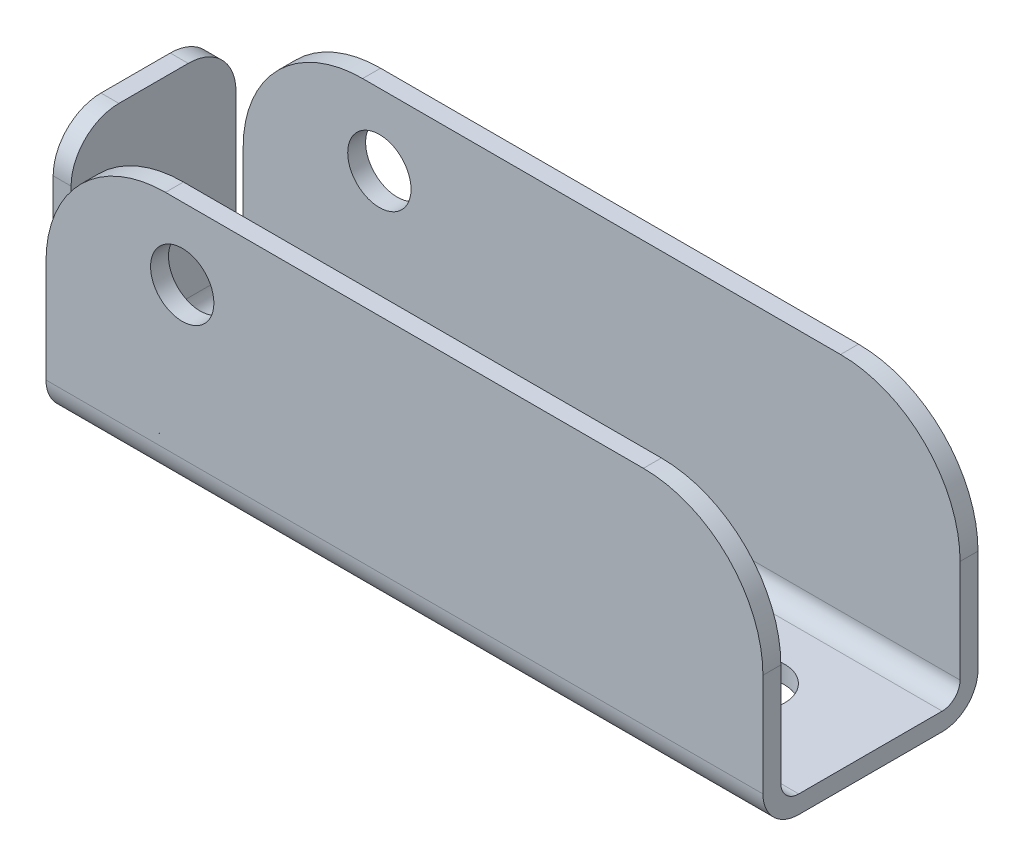
ISO-10303-21;
HEADER;
FILE_DESCRIPTION(('STEP AP214'),'2;1');
FILE_NAME('part.step','',(''),(''),'','','');
FILE_SCHEMA(('AUTOMOTIVE_DESIGN { 1 0 10303 214 1 1 1 1 }'));
ENDSEC;
DATA;
#1=APPLICATION_CONTEXT('core data for automotive mechanical design processes');
#2=APPLICATION_PROTOCOL_DEFINITION('international standard','automotive_design',2000,#1);
#3=PRODUCT_CONTEXT('',#1,'mechanical');
#4=PRODUCT('Part','Part','',(#3));
#5=PRODUCT_RELATED_PRODUCT_CATEGORY('part','',(#4));
#6=PRODUCT_DEFINITION_FORMATION('','',#4);
#7=PRODUCT_DEFINITION_CONTEXT('part definition',#1,'design');
#8=PRODUCT_DEFINITION('design','',#6,#7);
#9=PRODUCT_DEFINITION_SHAPE('','',#8);
#10=(LENGTH_UNIT() NAMED_UNIT(*) SI_UNIT(.MILLI.,.METRE.));
#11=(NAMED_UNIT(*) PLANE_ANGLE_UNIT() SI_UNIT($,.RADIAN.));
#12=(NAMED_UNIT(*) SI_UNIT($,.STERADIAN.) SOLID_ANGLE_UNIT());
#13=UNCERTAINTY_MEASURE_WITH_UNIT(LENGTH_MEASURE(1.E-05),#10,'distance_accuracy_value','');
#14=(GEOMETRIC_REPRESENTATION_CONTEXT(3) GLOBAL_UNCERTAINTY_ASSIGNED_CONTEXT((#13)) GLOBAL_UNIT_ASSIGNED_CONTEXT((#10,
#11,#12)) REPRESENTATION_CONTEXT('',''));
#15=CARTESIAN_POINT('',(0.,0.,0.));
#16=DIRECTION('',(0.,0.,1.));
#17=DIRECTION('',(1.,0.,0.));
#18=AXIS2_PLACEMENT_3D('',#15,#16,#17);
#19=CARTESIAN_POINT('',(0.,1.905,0.));
#20=DIRECTION('',(0.,-1.,0.));
#21=DIRECTION('',(0.,0.,-1.));
#22=AXIS2_PLACEMENT_3D('',#19,#20,#21);
#23=PLANE('',#22);
#24=CARTESIAN_POINT('',(65.405,1.905,0.));
#25=DIRECTION('',(0.,1.,0.));
#26=DIRECTION('',(0.,0.,1.));
#27=AXIS2_PLACEMENT_3D('',#24,#25,#26);
#28=CIRCLE('',#27,3.5687);
#29=CARTESIAN_POINT('',(65.405,1.905,3.5687));
#30=VERTEX_POINT('',#29);
#31=EDGE_CURVE('E273',#30,#30,#28,.T.);
#32=ORIENTED_EDGE('',*,*,#31,.F.);
#33=EDGE_LOOP('',(#32));
#34=FACE_BOUND('',#33,.T.);
#35=CARTESIAN_POINT('',(27.305,1.905,0.));
#36=DIRECTION('',(0.,1.,0.));
#37=DIRECTION('',(0.,0.,1.));
#38=AXIS2_PLACEMENT_3D('',#35,#36,#37);
#39=CIRCLE('',#38,3.5687);
#40=CARTESIAN_POINT('',(27.305,1.905,3.56870000000001));
#41=VERTEX_POINT('',#40);
#42=EDGE_CURVE('E562',#41,#41,#39,.T.);
#43=ORIENTED_EDGE('',*,*,#42,.F.);
#44=EDGE_LOOP('',(#43));
#45=FACE_BOUND('',#44,.T.);
#46=DIRECTION('',(0.,0.,-1.));
#47=VECTOR('',#46,1.);
#48=CARTESIAN_POINT('',(3.81,1.905,8.76299999999999));
#49=LINE('',#48,#47);
#50=CARTESIAN_POINT('',(3.80999999999999,1.905,-7.61999999999999));
#51=VERTEX_POINT('',#50);
#52=CARTESIAN_POINT('',(3.81,1.905,7.61999999999998));
#53=VERTEX_POINT('',#52);
#54=EDGE_CURVE('E343',#51,#53,#49,.F.);
#55=ORIENTED_EDGE('',*,*,#54,.T.);
#56=DIRECTION('',(-1.,0.,0.));
#57=VECTOR('',#56,1.);
#58=CARTESIAN_POINT('',(78.105,1.905,7.61999999999997));
#59=LINE('',#58,#57);
#60=CARTESIAN_POINT('',(78.105,1.905,7.61999999999997));
#61=VERTEX_POINT('',#60);
#62=EDGE_CURVE('E384',#53,#61,#59,.F.);
#63=ORIENTED_EDGE('',*,*,#62,.T.);
#64=DIRECTION('',(0.,0.,-1.));
#65=VECTOR('',#64,1.);
#66=CARTESIAN_POINT('',(78.105,1.905,-11.43));
#67=LINE('',#66,#65);
#68=CARTESIAN_POINT('',(78.105,1.905,-7.62));
#69=VERTEX_POINT('',#68);
#70=EDGE_CURVE('E260',#61,#69,#67,.T.);
#71=ORIENTED_EDGE('',*,*,#70,.T.);
#72=DIRECTION('',(1.,0.,0.));
#73=VECTOR('',#72,1.);
#74=CARTESIAN_POINT('',(1.90499999999999,1.905,-7.61999999999999));
#75=LINE('',#74,#73);
#76=EDGE_CURVE('E382',#69,#51,#75,.F.);
#77=ORIENTED_EDGE('',*,*,#76,.T.);
#78=EDGE_LOOP('',(#55,#63,#71,#77));
#79=FACE_BOUND('',#78,.T.);
#80=ADVANCED_FACE('F39',(#34,#45,#79),#23,.F.);
#81=CARTESIAN_POINT('',(0.,1.905,-11.43));
#82=DIRECTION('',(0.,0.,1.));
#83=DIRECTION('',(1.,0.,0.));
#84=AXIS2_PLACEMENT_3D('',#81,#82,#83);
#85=PLANE('',#84);
#86=CARTESIAN_POINT('',(16.383,19.812,-11.43));
#87=DIRECTION('',(0.,0.,1.));
#88=DIRECTION('',(1.,0.,0.));
#89=AXIS2_PLACEMENT_3D('',#86,#87,#88);
#90=CIRCLE('',#89,3.3655);
#91=CARTESIAN_POINT('',(19.7485,19.812,-11.43));
#92=VERTEX_POINT('',#91);
#93=EDGE_CURVE('E565',#92,#92,#90,.T.);
#94=ORIENTED_EDGE('',*,*,#93,.T.);
#95=EDGE_LOOP('',(#94));
#96=FACE_BOUND('',#95,.T.);
#97=DIRECTION('',(0.,-1.,0.));
#98=VECTOR('',#97,1.);
#99=CARTESIAN_POINT('',(78.105,1.905,-11.43));
#100=LINE('',#99,#98);
#101=CARTESIAN_POINT('',(78.105,14.732,-11.43));
#102=VERTEX_POINT('',#101);
#103=CARTESIAN_POINT('',(78.105,3.81,-11.43));
#104=VERTEX_POINT('',#103);
#105=EDGE_CURVE('E263',#102,#104,#100,.T.);
#106=ORIENTED_EDGE('',*,*,#105,.T.);
#107=DIRECTION('',(-1.,0.,0.));
#108=VECTOR('',#107,1.);
#109=CARTESIAN_POINT('',(3.81,3.81,-11.43));
#110=LINE('',#109,#108);
#111=CARTESIAN_POINT('',(1.905,3.81000000000001,-11.43));
#112=VERTEX_POINT('',#111);
#113=EDGE_CURVE('E368',#104,#112,#110,.T.);
#114=ORIENTED_EDGE('',*,*,#113,.T.);
#115=DIRECTION('',(0.,-1.,0.));
#116=VECTOR('',#115,1.);
#117=CARTESIAN_POINT('',(1.905,27.432,-11.43));
#118=LINE('',#117,#116);
#119=CARTESIAN_POINT('',(1.905,14.732,-11.43));
#120=VERTEX_POINT('',#119);
#121=EDGE_CURVE('E435',#120,#112,#118,.T.);
#122=ORIENTED_EDGE('',*,*,#121,.F.);
#123=CARTESIAN_POINT('',(14.605,14.732,-11.43));
#124=DIRECTION('',(0.,0.,1.));
#125=DIRECTION('',(1.,0.,0.));
#126=AXIS2_PLACEMENT_3D('',#123,#124,#125);
#127=CIRCLE('',#126,12.7);
#128=CARTESIAN_POINT('',(14.605,27.432,-11.43));
#129=VERTEX_POINT('',#128);
#130=EDGE_CURVE('E221',#120,#129,#127,.F.);
#131=ORIENTED_EDGE('',*,*,#130,.T.);
#132=DIRECTION('',(-1.,0.,0.));
#133=VECTOR('',#132,1.);
#134=CARTESIAN_POINT('',(1.905,27.432,-11.43));
#135=LINE('',#134,#133);
#136=CARTESIAN_POINT('',(65.405,27.432,-11.43));
#137=VERTEX_POINT('',#136);
#138=EDGE_CURVE('E229',#137,#129,#135,.T.);
#139=ORIENTED_EDGE('',*,*,#138,.F.);
#140=CARTESIAN_POINT('',(65.405,14.732,-11.43));
#141=DIRECTION('',(0.,0.,1.));
#142=DIRECTION('',(1.,0.,0.));
#143=AXIS2_PLACEMENT_3D('',#140,#141,#142);
#144=CIRCLE('',#143,12.7);
#145=EDGE_CURVE('E211',#137,#102,#144,.F.);
#146=ORIENTED_EDGE('',*,*,#145,.T.);
#147=EDGE_LOOP('',(#106,#114,#122,#131,#139,#146));
#148=FACE_BOUND('',#147,.T.);
#149=ADVANCED_FACE('F236',(#96,#148),#85,.F.);
#150=CARTESIAN_POINT('',(0.,1.905,11.43));
#151=DIRECTION('',(1.,0.,0.));
#152=DIRECTION('',(0.,0.,-1.));
#153=AXIS2_PLACEMENT_3D('',#150,#151,#152);
#154=PLANE('',#153);
#155=DIRECTION('',(0.,-1.,0.));
#156=VECTOR('',#155,1.);
#157=CARTESIAN_POINT('',(0.,25.4,-8.76299999999999));
#158=LINE('',#157,#156);
#159=CARTESIAN_POINT('',(0.,20.32,-8.76299999999999));
#160=VERTEX_POINT('',#159);
#161=CARTESIAN_POINT('',(0.,3.81,-8.76299999999999));
#162=VERTEX_POINT('',#161);
#163=EDGE_CURVE('E432',#160,#162,#158,.T.);
#164=ORIENTED_EDGE('',*,*,#163,.T.);
#165=DIRECTION('',(0.,0.,1.));
#166=VECTOR('',#165,1.);
#167=CARTESIAN_POINT('',(0.,3.81,8.76299999999999));
#168=LINE('',#167,#166);
#169=CARTESIAN_POINT('',(0.,3.81,8.76299999999999));
#170=VERTEX_POINT('',#169);
#171=EDGE_CURVE('E325',#162,#170,#168,.T.);
#172=ORIENTED_EDGE('',*,*,#171,.T.);
#173=DIRECTION('',(0.,-1.,0.));
#174=VECTOR('',#173,1.);
#175=CARTESIAN_POINT('',(0.,25.4,8.76299999999999));
#176=LINE('',#175,#174);
#177=CARTESIAN_POINT('',(0.,20.32,8.76299999999999));
#178=VERTEX_POINT('',#177);
#179=EDGE_CURVE('E423',#178,#170,#176,.T.);
#180=ORIENTED_EDGE('',*,*,#179,.F.);
#181=CARTESIAN_POINT('',(0.,20.32,3.68299999999999));
#182=DIRECTION('',(1.,0.,0.));
#183=DIRECTION('',(0.,0.,-1.));
#184=AXIS2_PLACEMENT_3D('',#181,#182,#183);
#185=CIRCLE('',#184,5.08);
#186=CARTESIAN_POINT('',(0.,25.4,3.68299999999999));
#187=VERTEX_POINT('',#186);
#188=EDGE_CURVE('E313',#178,#187,#185,.F.);
#189=ORIENTED_EDGE('',*,*,#188,.T.);
#190=DIRECTION('',(0.,0.,1.));
#191=VECTOR('',#190,1.);
#192=CARTESIAN_POINT('',(0.,25.4,8.76299999999999));
#193=LINE('',#192,#191);
#194=CARTESIAN_POINT('',(0.,25.4,-3.68299999999999));
#195=VERTEX_POINT('',#194);
#196=EDGE_CURVE('E426',#195,#187,#193,.T.);
#197=ORIENTED_EDGE('',*,*,#196,.F.);
#198=CARTESIAN_POINT('',(0.,20.32,-3.68299999999999));
#199=DIRECTION('',(1.,0.,0.));
#200=DIRECTION('',(0.,0.,-1.));
#201=AXIS2_PLACEMENT_3D('',#198,#199,#200);
#202=CIRCLE('',#201,5.08);
#203=EDGE_CURVE('E315',#195,#160,#202,.F.);
#204=ORIENTED_EDGE('',*,*,#203,.T.);
#205=EDGE_LOOP('',(#164,#172,#180,#189,#197,#204));
#206=FACE_BOUND('',#205,.T.);
#207=ADVANCED_FACE('F467',(#206),#154,.F.);
#208=CARTESIAN_POINT('',(78.105,1.905,11.43));
#209=DIRECTION('',(0.,0.,-1.));
#210=DIRECTION('',(-1.,0.,0.));
#211=AXIS2_PLACEMENT_3D('',#208,#209,#210);
#212=PLANE('',#211);
#213=CARTESIAN_POINT('',(16.383,19.812,11.43));
#214=DIRECTION('',(0.,0.,1.));
#215=DIRECTION('',(1.,0.,0.));
#216=AXIS2_PLACEMENT_3D('',#213,#214,#215);
#217=CIRCLE('',#216,3.3655);
#218=CARTESIAN_POINT('',(19.7485,19.812,11.43));
#219=VERTEX_POINT('',#218);
#220=EDGE_CURVE('E279',#219,#219,#217,.T.);
#221=ORIENTED_EDGE('',*,*,#220,.F.);
#222=EDGE_LOOP('',(#221));
#223=FACE_BOUND('',#222,.T.);
#224=DIRECTION('',(0.,-1.,0.));
#225=VECTOR('',#224,1.);
#226=CARTESIAN_POINT('',(1.905,27.432,11.43));
#227=LINE('',#226,#225);
#228=CARTESIAN_POINT('',(1.905,14.732,11.43));
#229=VERTEX_POINT('',#228);
#230=CARTESIAN_POINT('',(1.905,3.81000000000001,11.43));
#231=VERTEX_POINT('',#230);
#232=EDGE_CURVE('E250',#229,#231,#227,.T.);
#233=ORIENTED_EDGE('',*,*,#232,.T.);
#234=DIRECTION('',(1.,0.,0.));
#235=VECTOR('',#234,1.);
#236=CARTESIAN_POINT('',(78.105,3.81,11.43));
#237=LINE('',#236,#235);
#238=CARTESIAN_POINT('',(78.105,3.81,11.43));
#239=VERTEX_POINT('',#238);
#240=EDGE_CURVE('E351',#231,#239,#237,.T.);
#241=ORIENTED_EDGE('',*,*,#240,.T.);
#242=DIRECTION('',(0.,-1.,0.));
#243=VECTOR('',#242,1.);
#244=CARTESIAN_POINT('',(78.105,1.905,11.43));
#245=LINE('',#244,#243);
#246=CARTESIAN_POINT('',(78.105,14.732,11.43));
#247=VERTEX_POINT('',#246);
#248=EDGE_CURVE('E234',#247,#239,#245,.T.);
#249=ORIENTED_EDGE('',*,*,#248,.F.);
#250=CARTESIAN_POINT('',(65.405,14.732,11.43));
#251=DIRECTION('',(0.,0.,-1.));
#252=DIRECTION('',(-1.,0.,0.));
#253=AXIS2_PLACEMENT_3D('',#250,#251,#252);
#254=CIRCLE('',#253,12.7);
#255=CARTESIAN_POINT('',(65.405,27.432,11.43));
#256=VERTEX_POINT('',#255);
#257=EDGE_CURVE('E294',#247,#256,#254,.F.);
#258=ORIENTED_EDGE('',*,*,#257,.T.);
#259=DIRECTION('',(1.,0.,0.));
#260=VECTOR('',#259,1.);
#261=CARTESIAN_POINT('',(1.905,27.432,11.43));
#262=LINE('',#261,#260);
#263=CARTESIAN_POINT('',(14.605,27.432,11.43));
#264=VERTEX_POINT('',#263);
#265=EDGE_CURVE('E239',#264,#256,#262,.T.);
#266=ORIENTED_EDGE('',*,*,#265,.F.);
#267=CARTESIAN_POINT('',(14.605,14.732,11.43));
#268=DIRECTION('',(0.,0.,-1.));
#269=DIRECTION('',(-1.,0.,0.));
#270=AXIS2_PLACEMENT_3D('',#267,#268,#269);
#271=CIRCLE('',#270,12.7);
#272=EDGE_CURVE('E296',#264,#229,#271,.F.);
#273=ORIENTED_EDGE('',*,*,#272,.T.);
#274=EDGE_LOOP('',(#233,#241,#249,#258,#266,#273));
#275=FACE_BOUND('',#274,.T.);
#276=ADVANCED_FACE('F481',(#223,#275),#212,.F.);
#277=CARTESIAN_POINT('',(78.105,1.905,-11.43));
#278=DIRECTION('',(-1.,0.,0.));
#279=DIRECTION('',(0.,0.,1.));
#280=AXIS2_PLACEMENT_3D('',#277,#278,#279);
#281=PLANE('',#280);
#282=ORIENTED_EDGE('',*,*,#248,.T.);
#283=CARTESIAN_POINT('',(78.105,3.81,7.61999999999997));
#284=DIRECTION('',(-1.,0.,0.));
#285=DIRECTION('',(0.,0.,1.));
#286=AXIS2_PLACEMENT_3D('',#283,#284,#285);
#287=CIRCLE('',#286,3.81);
#288=CARTESIAN_POINT('',(78.105,0.,7.61999999999997));
#289=VERTEX_POINT('',#288);
#290=EDGE_CURVE('E356',#239,#289,#287,.F.);
#291=ORIENTED_EDGE('',*,*,#290,.T.);
#292=DIRECTION('',(0.,0.,-1.));
#293=VECTOR('',#292,1.);
#294=CARTESIAN_POINT('',(78.105,0.,-11.43));
#295=LINE('',#294,#293);
#296=CARTESIAN_POINT('',(78.105,0.,-7.62));
#297=VERTEX_POINT('',#296);
#298=EDGE_CURVE('E259',#289,#297,#295,.T.);
#299=ORIENTED_EDGE('',*,*,#298,.T.);
#300=CARTESIAN_POINT('',(78.105,3.81,-7.62));
#301=DIRECTION('',(-1.,0.,0.));
#302=DIRECTION('',(0.,0.,1.));
#303=AXIS2_PLACEMENT_3D('',#300,#301,#302);
#304=CIRCLE('',#303,3.81);
#305=EDGE_CURVE('E354',#297,#104,#304,.F.);
#306=ORIENTED_EDGE('',*,*,#305,.T.);
#307=ORIENTED_EDGE('',*,*,#105,.F.);
#308=DIRECTION('',(0.,0.,-1.));
#309=VECTOR('',#308,1.);
#310=CARTESIAN_POINT('',(78.105,14.732,-11.43));
#311=LINE('',#310,#309);
#312=CARTESIAN_POINT('',(78.105,14.732,-9.525));
#313=VERTEX_POINT('',#312);
#314=EDGE_CURVE('E216',#102,#313,#311,.F.);
#315=ORIENTED_EDGE('',*,*,#314,.T.);
#316=DIRECTION('',(0.,-1.,0.));
#317=VECTOR('',#316,1.);
#318=CARTESIAN_POINT('',(78.105,27.432,-9.525));
#319=LINE('',#318,#317);
#320=CARTESIAN_POINT('',(78.105,3.81000000000001,-9.525));
#321=VERTEX_POINT('',#320);
#322=EDGE_CURVE('E244',#313,#321,#319,.T.);
#323=ORIENTED_EDGE('',*,*,#322,.T.);
#324=CARTESIAN_POINT('',(78.105,3.81,-7.62));
#325=DIRECTION('',(-1.,0.,0.));
#326=DIRECTION('',(0.,0.,1.));
#327=AXIS2_PLACEMENT_3D('',#324,#325,#326);
#328=CIRCLE('',#327,1.905);
#329=EDGE_CURVE('E47',#321,#69,#328,.T.);
#330=ORIENTED_EDGE('',*,*,#329,.T.);
#331=ORIENTED_EDGE('',*,*,#70,.F.);
#332=CARTESIAN_POINT('',(78.105,3.81,7.61999999999997));
#333=DIRECTION('',(-1.,0.,0.));
#334=DIRECTION('',(0.,0.,1.));
#335=AXIS2_PLACEMENT_3D('',#332,#333,#334);
#336=CIRCLE('',#335,1.905);
#337=CARTESIAN_POINT('',(78.105,3.81000000000001,9.52499999999997));
#338=VERTEX_POINT('',#337);
#339=EDGE_CURVE('E393',#61,#338,#336,.T.);
#340=ORIENTED_EDGE('',*,*,#339,.T.);
#341=DIRECTION('',(0.,-1.,0.));
#342=VECTOR('',#341,1.);
#343=CARTESIAN_POINT('',(78.105,27.432,9.52499999999997));
#344=LINE('',#343,#342);
#345=CARTESIAN_POINT('',(78.105,14.732,9.52499999999997));
#346=VERTEX_POINT('',#345);
#347=EDGE_CURVE('E256',#346,#338,#344,.T.);
#348=ORIENTED_EDGE('',*,*,#347,.F.);
#349=DIRECTION('',(0.,0.,-1.));
#350=VECTOR('',#349,1.);
#351=CARTESIAN_POINT('',(78.105,14.732,11.43));
#352=LINE('',#351,#350);
#353=EDGE_CURVE('E304',#346,#247,#352,.F.);
#354=ORIENTED_EDGE('',*,*,#353,.T.);
#355=EDGE_LOOP('',(#282,#291,#299,#306,#307,#315,#323,#330,#331,#340,#348,#354));
#356=FACE_BOUND('',#355,.T.);
#357=ADVANCED_FACE('F397',(#356),#281,.F.);
#358=CARTESIAN_POINT('',(0.,0.,0.));
#359=DIRECTION('',(0.,-1.,0.));
#360=DIRECTION('',(0.,0.,-1.));
#361=AXIS2_PLACEMENT_3D('',#358,#359,#360);
#362=PLANE('',#361);
#363=CARTESIAN_POINT('',(65.405,0.,0.));
#364=DIRECTION('',(0.,-1.,0.));
#365=DIRECTION('',(0.,0.,-1.));
#366=AXIS2_PLACEMENT_3D('',#363,#364,#365);
#367=CIRCLE('',#366,3.5687);
#368=CARTESIAN_POINT('',(65.405,0.,-3.5687));
#369=VERTEX_POINT('',#368);
#370=EDGE_CURVE('E272',#369,#369,#367,.T.);
#371=ORIENTED_EDGE('',*,*,#370,.F.);
#372=EDGE_LOOP('',(#371));
#373=FACE_BOUND('',#372,.T.);
#374=CARTESIAN_POINT('',(27.305,0.,0.));
#375=DIRECTION('',(0.,-1.,0.));
#376=DIRECTION('',(0.,0.,-1.));
#377=AXIS2_PLACEMENT_3D('',#374,#375,#376);
#378=CIRCLE('',#377,3.5687);
#379=CARTESIAN_POINT('',(27.305,0.,-3.5687));
#380=VERTEX_POINT('',#379);
#381=EDGE_CURVE('E269',#380,#380,#378,.T.);
#382=ORIENTED_EDGE('',*,*,#381,.F.);
#383=EDGE_LOOP('',(#382));
#384=FACE_BOUND('',#383,.T.);
#385=ORIENTED_EDGE('',*,*,#298,.F.);
#386=DIRECTION('',(1.,0.,0.));
#387=VECTOR('',#386,1.);
#388=CARTESIAN_POINT('',(3.80999999999999,0.,7.62));
#389=LINE('',#388,#387);
#390=CARTESIAN_POINT('',(3.81,0.,7.62));
#391=VERTEX_POINT('',#390);
#392=EDGE_CURVE('E360',#289,#391,#389,.F.);
#393=ORIENTED_EDGE('',*,*,#392,.T.);
#394=DIRECTION('',(0.,0.,1.));
#395=VECTOR('',#394,1.);
#396=CARTESIAN_POINT('',(3.81,0.,-8.76299999999999));
#397=LINE('',#396,#395);
#398=CARTESIAN_POINT('',(3.81,0.,-7.62));
#399=VERTEX_POINT('',#398);
#400=EDGE_CURVE('E333',#391,#399,#397,.F.);
#401=ORIENTED_EDGE('',*,*,#400,.T.);
#402=DIRECTION('',(-1.,0.,0.));
#403=VECTOR('',#402,1.);
#404=CARTESIAN_POINT('',(78.105,0.,-7.62));
#405=LINE('',#404,#403);
#406=EDGE_CURVE('E358',#399,#297,#405,.F.);
#407=ORIENTED_EDGE('',*,*,#406,.T.);
#408=EDGE_LOOP('',(#385,#393,#401,#407));
#409=FACE_BOUND('',#408,.T.);
#410=ADVANCED_FACE('F476',(#373,#384,#409),#362,.T.);
#411=CARTESIAN_POINT('',(78.105,27.432,9.52499999999997));
#412=DIRECTION('',(0.,0.,1.));
#413=DIRECTION('',(1.,0.,0.));
#414=AXIS2_PLACEMENT_3D('',#411,#412,#413);
#415=PLANE('',#414);
#416=CARTESIAN_POINT('',(16.383,19.812,9.52499999999998));
#417=DIRECTION('',(0.,0.,1.));
#418=DIRECTION('',(1.,0.,0.));
#419=AXIS2_PLACEMENT_3D('',#416,#417,#418);
#420=CIRCLE('',#419,3.3655);
#421=CARTESIAN_POINT('',(19.7485,19.812,9.52499999999998));
#422=VERTEX_POINT('',#421);
#423=EDGE_CURVE('E278',#422,#422,#420,.T.);
#424=ORIENTED_EDGE('',*,*,#423,.T.);
#425=EDGE_LOOP('',(#424));
#426=FACE_BOUND('',#425,.T.);
#427=ORIENTED_EDGE('',*,*,#347,.T.);
#428=DIRECTION('',(-1.,0.,0.));
#429=VECTOR('',#428,1.);
#430=CARTESIAN_POINT('',(1.905,3.81,9.52499999999998));
#431=LINE('',#430,#429);
#432=CARTESIAN_POINT('',(1.905,3.81000000000001,9.52499999999998));
#433=VERTEX_POINT('',#432);
#434=EDGE_CURVE('E373',#338,#433,#431,.T.);
#435=ORIENTED_EDGE('',*,*,#434,.T.);
#436=DIRECTION('',(0.,-1.,0.));
#437=VECTOR('',#436,1.);
#438=CARTESIAN_POINT('',(1.905,27.432,9.52499999999998));
#439=LINE('',#438,#437);
#440=CARTESIAN_POINT('',(1.905,14.732,9.52499999999998));
#441=VERTEX_POINT('',#440);
#442=EDGE_CURVE('E253',#441,#433,#439,.T.);
#443=ORIENTED_EDGE('',*,*,#442,.F.);
#444=CARTESIAN_POINT('',(14.605,14.732,9.52499999999998));
#445=DIRECTION('',(0.,0.,1.));
#446=DIRECTION('',(1.,0.,0.));
#447=AXIS2_PLACEMENT_3D('',#444,#445,#446);
#448=CIRCLE('',#447,12.7);
#449=CARTESIAN_POINT('',(14.605,27.432,9.52499999999998));
#450=VERTEX_POINT('',#449);
#451=EDGE_CURVE('E302',#441,#450,#448,.F.);
#452=ORIENTED_EDGE('',*,*,#451,.T.);
#453=DIRECTION('',(-1.,0.,0.));
#454=VECTOR('',#453,1.);
#455=CARTESIAN_POINT('',(78.105,27.432,9.52499999999997));
#456=LINE('',#455,#454);
#457=CARTESIAN_POINT('',(65.405,27.432,9.52499999999997));
#458=VERTEX_POINT('',#457);
#459=EDGE_CURVE('E242',#458,#450,#456,.T.);
#460=ORIENTED_EDGE('',*,*,#459,.F.);
#461=CARTESIAN_POINT('',(65.405,14.732,9.52499999999997));
#462=DIRECTION('',(0.,0.,1.));
#463=DIRECTION('',(1.,0.,0.));
#464=AXIS2_PLACEMENT_3D('',#461,#462,#463);
#465=CIRCLE('',#464,12.7);
#466=EDGE_CURVE('E300',#458,#346,#465,.F.);
#467=ORIENTED_EDGE('',*,*,#466,.T.);
#468=EDGE_LOOP('',(#427,#435,#443,#452,#460,#467));
#469=FACE_BOUND('',#468,.T.);
#470=ADVANCED_FACE('F474',(#426,#469),#415,.F.);
#471=CARTESIAN_POINT('',(1.905,27.432,9.52499999999998));
#472=DIRECTION('',(1.,0.,0.));
#473=DIRECTION('',(0.,0.,-1.));
#474=AXIS2_PLACEMENT_3D('',#471,#472,#473);
#475=PLANE('',#474);
#476=DIRECTION('',(0.,0.,-1.));
#477=VECTOR('',#476,1.);
#478=CARTESIAN_POINT('',(1.905,0.51044321158129,8.76299999999999));
#479=LINE('',#478,#477);
#480=CARTESIAN_POINT('',(1.905,0.51044321158129,8.76299999999999));
#481=VERTEX_POINT('',#480);
#482=CARTESIAN_POINT('',(1.905,0.51044321158129,9.525));
#483=VERTEX_POINT('',#482);
#484=EDGE_CURVE('E330',#481,#483,#479,.F.);
#485=ORIENTED_EDGE('',*,*,#484,.T.);
#486=CARTESIAN_POINT('',(1.905,3.81,7.62));
#487=DIRECTION('',(1.,0.,0.));
#488=DIRECTION('',(0.,0.,-1.));
#489=AXIS2_PLACEMENT_3D('',#486,#487,#488);
#490=CIRCLE('',#489,3.81);
#491=EDGE_CURVE('E366',#483,#231,#490,.F.);
#492=ORIENTED_EDGE('',*,*,#491,.T.);
#493=ORIENTED_EDGE('',*,*,#232,.F.);
#494=DIRECTION('',(0.,0.,1.));
#495=VECTOR('',#494,1.);
#496=CARTESIAN_POINT('',(1.905,14.732,9.52499999999998));
#497=LINE('',#496,#495);
#498=EDGE_CURVE('E298',#229,#441,#497,.F.);
#499=ORIENTED_EDGE('',*,*,#498,.T.);
#500=ORIENTED_EDGE('',*,*,#442,.T.);
#501=CARTESIAN_POINT('',(1.905,3.81,7.61999999999998));
#502=DIRECTION('',(1.,0.,0.));
#503=DIRECTION('',(0.,0.,-1.));
#504=AXIS2_PLACEMENT_3D('',#501,#502,#503);
#505=CIRCLE('',#504,1.905);
#506=CARTESIAN_POINT('',(1.905,2.28599999999976,8.76299999999999));
#507=VERTEX_POINT('',#506);
#508=EDGE_CURVE('E390',#433,#507,#505,.T.);
#509=ORIENTED_EDGE('',*,*,#508,.T.);
#510=DIRECTION('',(0.,1.,0.));
#511=VECTOR('',#510,1.);
#512=CARTESIAN_POINT('',(1.905,-23.495,8.76299999999999));
#513=LINE('',#512,#511);
#514=EDGE_CURVE('E555',#481,#507,#513,.T.);
#515=ORIENTED_EDGE('',*,*,#514,.F.);
#516=EDGE_LOOP('',(#485,#492,#493,#499,#500,#509,#515));
#517=FACE_BOUND('',#516,.T.);
#518=ADVANCED_FACE('F455',(#517),#475,.F.);
#519=CARTESIAN_POINT('',(0.,27.432,0.));
#520=DIRECTION('',(0.,1.,0.));
#521=DIRECTION('',(0.,0.,1.));
#522=AXIS2_PLACEMENT_3D('',#519,#520,#521);
#523=PLANE('',#522);
#524=ORIENTED_EDGE('',*,*,#459,.T.);
#525=DIRECTION('',(0.,0.,1.));
#526=VECTOR('',#525,1.);
#527=CARTESIAN_POINT('',(14.605,27.432,11.43));
#528=LINE('',#527,#526);
#529=EDGE_CURVE('E291',#450,#264,#528,.T.);
#530=ORIENTED_EDGE('',*,*,#529,.T.);
#531=ORIENTED_EDGE('',*,*,#265,.T.);
#532=DIRECTION('',(0.,0.,-1.));
#533=VECTOR('',#532,1.);
#534=CARTESIAN_POINT('',(65.405,27.432,9.52499999999997));
#535=LINE('',#534,#533);
#536=EDGE_CURVE('E288',#256,#458,#535,.T.);
#537=ORIENTED_EDGE('',*,*,#536,.T.);
#538=EDGE_LOOP('',(#524,#530,#531,#537));
#539=FACE_BOUND('',#538,.T.);
#540=ADVANCED_FACE('F446',(#539),#523,.T.);
#541=CARTESIAN_POINT('',(1.905,27.432,-9.52499999999999));
#542=DIRECTION('',(1.,0.,0.));
#543=DIRECTION('',(0.,0.,-1.));
#544=AXIS2_PLACEMENT_3D('',#541,#542,#543);
#545=PLANE('',#544);
#546=ORIENTED_EDGE('',*,*,#121,.T.);
#547=CARTESIAN_POINT('',(1.905,3.81,-7.62));
#548=DIRECTION('',(1.,0.,0.));
#549=DIRECTION('',(0.,0.,-1.));
#550=AXIS2_PLACEMENT_3D('',#547,#548,#549);
#551=CIRCLE('',#550,3.81);
#552=CARTESIAN_POINT('',(1.905,0.51044321158129,-9.525));
#553=VERTEX_POINT('',#552);
#554=EDGE_CURVE('E371',#112,#553,#551,.F.);
#555=ORIENTED_EDGE('',*,*,#554,.T.);
#556=DIRECTION('',(0.,0.,-1.));
#557=VECTOR('',#556,1.);
#558=CARTESIAN_POINT('',(1.905,0.51044321158129,-11.43));
#559=LINE('',#558,#557);
#560=CARTESIAN_POINT('',(1.90499999999999,0.510443211581293,-8.76299999999999));
#561=VERTEX_POINT('',#560);
#562=EDGE_CURVE('E336',#553,#561,#559,.F.);
#563=ORIENTED_EDGE('',*,*,#562,.T.);
#564=DIRECTION('',(0.,1.,0.));
#565=VECTOR('',#564,1.);
#566=CARTESIAN_POINT('',(1.90499999999999,-23.495,-8.76299999999999));
#567=LINE('',#566,#565);
#568=CARTESIAN_POINT('',(1.905,2.28599999999975,-8.76299999999999));
#569=VERTEX_POINT('',#568);
#570=EDGE_CURVE('E53',#561,#569,#567,.T.);
#571=ORIENTED_EDGE('',*,*,#570,.T.);
#572=CARTESIAN_POINT('',(1.905,3.81,-7.61999999999999));
#573=DIRECTION('',(1.,0.,0.));
#574=DIRECTION('',(0.,0.,-1.));
#575=AXIS2_PLACEMENT_3D('',#572,#573,#574);
#576=CIRCLE('',#575,1.905);
#577=CARTESIAN_POINT('',(1.905,3.81000000000001,-9.52499999999999));
#578=VERTEX_POINT('',#577);
#579=EDGE_CURVE('E11',#569,#578,#576,.T.);
#580=ORIENTED_EDGE('',*,*,#579,.T.);
#581=DIRECTION('',(0.,-1.,0.));
#582=VECTOR('',#581,1.);
#583=CARTESIAN_POINT('',(1.905,27.432,-9.52499999999999));
#584=LINE('',#583,#582);
#585=CARTESIAN_POINT('',(1.905,14.732,-9.52499999999999));
#586=VERTEX_POINT('',#585);
#587=EDGE_CURVE('E438',#586,#578,#584,.T.);
#588=ORIENTED_EDGE('',*,*,#587,.F.);
#589=DIRECTION('',(0.,0.,1.));
#590=VECTOR('',#589,1.);
#591=CARTESIAN_POINT('',(1.905,14.732,-9.52499999999999));
#592=LINE('',#591,#590);
#593=EDGE_CURVE('E222',#586,#120,#592,.F.);
#594=ORIENTED_EDGE('',*,*,#593,.T.);
#595=EDGE_LOOP('',(#546,#555,#563,#571,#580,#588,#594));
#596=FACE_BOUND('',#595,.T.);
#597=ADVANCED_FACE('F444',(#596),#545,.F.);
#598=CARTESIAN_POINT('',(78.105,27.432,-9.525));
#599=DIRECTION('',(0.,0.,-1.));
#600=DIRECTION('',(-1.,0.,0.));
#601=AXIS2_PLACEMENT_3D('',#598,#599,#600);
#602=PLANE('',#601);
#603=CARTESIAN_POINT('',(16.383,19.812,-9.52499999999999));
#604=DIRECTION('',(0.,0.,-1.));
#605=DIRECTION('',(-1.,0.,0.));
#606=AXIS2_PLACEMENT_3D('',#603,#604,#605);
#607=CIRCLE('',#606,3.3655);
#608=CARTESIAN_POINT('',(13.0175,19.812,-9.52499999999999));
#609=VERTEX_POINT('',#608);
#610=EDGE_CURVE('E276',#609,#609,#607,.T.);
#611=ORIENTED_EDGE('',*,*,#610,.T.);
#612=EDGE_LOOP('',(#611));
#613=FACE_BOUND('',#612,.T.);
#614=ORIENTED_EDGE('',*,*,#587,.T.);
#615=DIRECTION('',(1.,0.,0.));
#616=VECTOR('',#615,1.);
#617=CARTESIAN_POINT('',(78.105,3.81,-9.525));
#618=LINE('',#617,#616);
#619=EDGE_CURVE('E386',#578,#321,#618,.T.);
#620=ORIENTED_EDGE('',*,*,#619,.T.);
#621=ORIENTED_EDGE('',*,*,#322,.F.);
#622=CARTESIAN_POINT('',(65.405,14.732,-9.525));
#623=DIRECTION('',(0.,0.,-1.));
#624=DIRECTION('',(-1.,0.,0.));
#625=AXIS2_PLACEMENT_3D('',#622,#623,#624);
#626=CIRCLE('',#625,12.7);
#627=CARTESIAN_POINT('',(65.405,27.432,-9.525));
#628=VERTEX_POINT('',#627);
#629=EDGE_CURVE('E282',#313,#628,#626,.F.);
#630=ORIENTED_EDGE('',*,*,#629,.T.);
#631=DIRECTION('',(1.,0.,0.));
#632=VECTOR('',#631,1.);
#633=CARTESIAN_POINT('',(78.105,27.432,-9.525));
#634=LINE('',#633,#632);
#635=CARTESIAN_POINT('',(14.605,27.432,-9.52499999999999));
#636=VERTEX_POINT('',#635);
#637=EDGE_CURVE('E232',#636,#628,#634,.T.);
#638=ORIENTED_EDGE('',*,*,#637,.F.);
#639=CARTESIAN_POINT('',(14.605,14.732,-9.52499999999999));
#640=DIRECTION('',(0.,0.,-1.));
#641=DIRECTION('',(-1.,0.,0.));
#642=AXIS2_PLACEMENT_3D('',#639,#640,#641);
#643=CIRCLE('',#642,12.7);
#644=EDGE_CURVE('E284',#636,#586,#643,.F.);
#645=ORIENTED_EDGE('',*,*,#644,.T.);
#646=EDGE_LOOP('',(#614,#620,#621,#630,#638,#645));
#647=FACE_BOUND('',#646,.T.);
#648=ADVANCED_FACE('F442',(#613,#647),#602,.F.);
#649=CARTESIAN_POINT('',(0.,27.432,0.));
#650=DIRECTION('',(0.,-1.,0.));
#651=DIRECTION('',(0.,0.,-1.));
#652=AXIS2_PLACEMENT_3D('',#649,#650,#651);
#653=PLANE('',#652);
#654=ORIENTED_EDGE('',*,*,#138,.T.);
#655=DIRECTION('',(0.,0.,1.));
#656=VECTOR('',#655,1.);
#657=CARTESIAN_POINT('',(14.605,27.432,0.));
#658=LINE('',#657,#656);
#659=EDGE_CURVE('E233',#129,#636,#658,.T.);
#660=ORIENTED_EDGE('',*,*,#659,.T.);
#661=ORIENTED_EDGE('',*,*,#637,.T.);
#662=DIRECTION('',(0.,0.,-1.));
#663=VECTOR('',#662,1.);
#664=CARTESIAN_POINT('',(65.405,27.432,0.));
#665=LINE('',#664,#663);
#666=EDGE_CURVE('E215',#628,#137,#665,.T.);
#667=ORIENTED_EDGE('',*,*,#666,.T.);
#668=EDGE_LOOP('',(#654,#660,#661,#667));
#669=FACE_BOUND('',#668,.T.);
#670=ADVANCED_FACE('F227',(#669),#653,.F.);
#671=CARTESIAN_POINT('',(0.,25.4,-8.76299999999999));
#672=DIRECTION('',(0.,0.,1.));
#673=DIRECTION('',(1.,0.,0.));
#674=AXIS2_PLACEMENT_3D('',#671,#672,#673);
#675=PLANE('',#674);
#676=DIRECTION('',(-1.,0.,0.));
#677=VECTOR('',#676,1.);
#678=CARTESIAN_POINT('',(2.667,2.286,-8.76299999999999));
#679=LINE('',#678,#677);
#680=CARTESIAN_POINT('',(2.667,2.286,-8.76299999999999));
#681=VERTEX_POINT('',#680);
#682=EDGE_CURVE('E388',#681,#569,#679,.T.);
#683=ORIENTED_EDGE('',*,*,#682,.T.);
#684=ORIENTED_EDGE('',*,*,#570,.F.);
#685=CARTESIAN_POINT('',(3.81,3.81,-8.76299999999999));
#686=DIRECTION('',(0.,0.,1.));
#687=DIRECTION('',(1.,0.,0.));
#688=AXIS2_PLACEMENT_3D('',#685,#686,#687);
#689=CIRCLE('',#688,3.81);
#690=EDGE_CURVE('E338',#561,#162,#689,.F.);
#691=ORIENTED_EDGE('',*,*,#690,.T.);
#692=ORIENTED_EDGE('',*,*,#163,.F.);
#693=DIRECTION('',(-1.,0.,0.));
#694=VECTOR('',#693,1.);
#695=CARTESIAN_POINT('',(0.,20.32,-8.76299999999999));
#696=LINE('',#695,#694);
#697=CARTESIAN_POINT('',(1.90499999999999,20.32,-8.76299999999999));
#698=VERTEX_POINT('',#697);
#699=EDGE_CURVE('E317',#160,#698,#696,.F.);
#700=ORIENTED_EDGE('',*,*,#699,.T.);
#701=DIRECTION('',(0.,-1.,0.));
#702=VECTOR('',#701,1.);
#703=CARTESIAN_POINT('',(1.90499999999999,25.4,-8.76299999999999));
#704=LINE('',#703,#702);
#705=CARTESIAN_POINT('',(1.90499999999999,3.81,-8.76299999999999));
#706=VERTEX_POINT('',#705);
#707=EDGE_CURVE('E414',#698,#706,#704,.T.);
#708=ORIENTED_EDGE('',*,*,#707,.T.);
#709=CARTESIAN_POINT('',(3.80999999999999,3.81,-8.76299999999999));
#710=DIRECTION('',(0.,0.,1.));
#711=DIRECTION('',(1.,0.,0.));
#712=AXIS2_PLACEMENT_3D('',#709,#710,#711);
#713=CIRCLE('',#712,1.905);
#714=EDGE_CURVE('E346',#706,#681,#713,.T.);
#715=ORIENTED_EDGE('',*,*,#714,.T.);
#716=EDGE_LOOP('',(#683,#684,#691,#692,#700,#708,#715));
#717=FACE_BOUND('',#716,.T.);
#718=ADVANCED_FACE('F412',(#717),#675,.F.);
#719=CARTESIAN_POINT('',(1.905,25.4,8.76299999999999));
#720=DIRECTION('',(0.,0.,-1.));
#721=DIRECTION('',(-1.,0.,0.));
#722=AXIS2_PLACEMENT_3D('',#719,#720,#721);
#723=PLANE('',#722);
#724=ORIENTED_EDGE('',*,*,#514,.T.);
#725=DIRECTION('',(1.,0.,0.));
#726=VECTOR('',#725,1.);
#727=CARTESIAN_POINT('',(1.905,2.28599999999976,8.76299999999999));
#728=LINE('',#727,#726);
#729=CARTESIAN_POINT('',(2.66699999999998,2.28600000000002,8.76299999999999));
#730=VERTEX_POINT('',#729);
#731=EDGE_CURVE('E376',#507,#730,#728,.T.);
#732=ORIENTED_EDGE('',*,*,#731,.T.);
#733=CARTESIAN_POINT('',(3.81,3.81,8.76299999999999));
#734=DIRECTION('',(0.,0.,-1.));
#735=DIRECTION('',(-1.,0.,0.));
#736=AXIS2_PLACEMENT_3D('',#733,#734,#735);
#737=CIRCLE('',#736,1.905);
#738=CARTESIAN_POINT('',(1.905,3.81,8.76299999999999));
#739=VERTEX_POINT('',#738);
#740=EDGE_CURVE('E349',#730,#739,#737,.T.);
#741=ORIENTED_EDGE('',*,*,#740,.T.);
#742=DIRECTION('',(0.,-1.,0.));
#743=VECTOR('',#742,1.);
#744=CARTESIAN_POINT('',(1.905,25.4,8.76299999999999));
#745=LINE('',#744,#743);
#746=CARTESIAN_POINT('',(1.905,20.32,8.76299999999999));
#747=VERTEX_POINT('',#746);
#748=EDGE_CURVE('E419',#747,#739,#745,.T.);
#749=ORIENTED_EDGE('',*,*,#748,.F.);
#750=DIRECTION('',(1.,0.,0.));
#751=VECTOR('',#750,1.);
#752=CARTESIAN_POINT('',(1.905,20.32,8.76299999999999));
#753=LINE('',#752,#751);
#754=EDGE_CURVE('E323',#747,#178,#753,.F.);
#755=ORIENTED_EDGE('',*,*,#754,.T.);
#756=ORIENTED_EDGE('',*,*,#179,.T.);
#757=CARTESIAN_POINT('',(3.81,3.81,8.76299999999999));
#758=DIRECTION('',(0.,0.,-1.));
#759=DIRECTION('',(-1.,0.,0.));
#760=AXIS2_PLACEMENT_3D('',#757,#758,#759);
#761=CIRCLE('',#760,3.81);
#762=EDGE_CURVE('E328',#170,#481,#761,.F.);
#763=ORIENTED_EDGE('',*,*,#762,.T.);
#764=EDGE_LOOP('',(#724,#732,#741,#749,#755,#756,#763));
#765=FACE_BOUND('',#764,.T.);
#766=ADVANCED_FACE('F591',(#765),#723,.F.);
#767=CARTESIAN_POINT('',(1.90499999999999,25.4,-8.76299999999999));
#768=DIRECTION('',(-1.,0.,0.));
#769=DIRECTION('',(0.,0.,1.));
#770=AXIS2_PLACEMENT_3D('',#767,#768,#769);
#771=PLANE('',#770);
#772=ORIENTED_EDGE('',*,*,#748,.T.);
#773=DIRECTION('',(0.,0.,-1.));
#774=VECTOR('',#773,1.);
#775=CARTESIAN_POINT('',(1.90499999999999,3.81,-8.76299999999999));
#776=LINE('',#775,#774);
#777=EDGE_CURVE('E340',#739,#706,#776,.T.);
#778=ORIENTED_EDGE('',*,*,#777,.T.);
#779=ORIENTED_EDGE('',*,*,#707,.F.);
#780=CARTESIAN_POINT('',(1.90499999999999,20.32,-3.68299999999999));
#781=DIRECTION('',(-1.,0.,0.));
#782=DIRECTION('',(0.,0.,1.));
#783=AXIS2_PLACEMENT_3D('',#780,#781,#782);
#784=CIRCLE('',#783,5.08);
#785=CARTESIAN_POINT('',(1.90499999999999,25.4,-3.68299999999999));
#786=VERTEX_POINT('',#785);
#787=EDGE_CURVE('E321',#698,#786,#784,.F.);
#788=ORIENTED_EDGE('',*,*,#787,.T.);
#789=DIRECTION('',(0.,0.,-1.));
#790=VECTOR('',#789,1.);
#791=CARTESIAN_POINT('',(1.90499999999999,25.4,-8.76299999999999));
#792=LINE('',#791,#790);
#793=CARTESIAN_POINT('',(1.905,25.4,3.68299999999999));
#794=VERTEX_POINT('',#793);
#795=EDGE_CURVE('E420',#794,#786,#792,.T.);
#796=ORIENTED_EDGE('',*,*,#795,.F.);
#797=CARTESIAN_POINT('',(1.905,20.32,3.68299999999999));
#798=DIRECTION('',(-1.,0.,0.));
#799=DIRECTION('',(0.,0.,1.));
#800=AXIS2_PLACEMENT_3D('',#797,#798,#799);
#801=CIRCLE('',#800,5.08);
#802=EDGE_CURVE('E319',#794,#747,#801,.F.);
#803=ORIENTED_EDGE('',*,*,#802,.T.);
#804=EDGE_LOOP('',(#772,#778,#779,#788,#796,#803));
#805=FACE_BOUND('',#804,.T.);
#806=ADVANCED_FACE('F595',(#805),#771,.F.);
#807=CARTESIAN_POINT('',(0.,25.4,0.));
#808=DIRECTION('',(0.,-1.,0.));
#809=DIRECTION('',(0.,0.,-1.));
#810=AXIS2_PLACEMENT_3D('',#807,#808,#809);
#811=PLANE('',#810);
#812=ORIENTED_EDGE('',*,*,#795,.T.);
#813=DIRECTION('',(-1.,0.,0.));
#814=VECTOR('',#813,1.);
#815=CARTESIAN_POINT('',(0.,25.4,-3.68299999999999));
#816=LINE('',#815,#814);
#817=EDGE_CURVE('E310',#786,#195,#816,.T.);
#818=ORIENTED_EDGE('',*,*,#817,.T.);
#819=ORIENTED_EDGE('',*,*,#196,.T.);
#820=DIRECTION('',(1.,0.,0.));
#821=VECTOR('',#820,1.);
#822=CARTESIAN_POINT('',(0.,25.4,3.68299999999999));
#823=LINE('',#822,#821);
#824=EDGE_CURVE('E307',#187,#794,#823,.T.);
#825=ORIENTED_EDGE('',*,*,#824,.T.);
#826=EDGE_LOOP('',(#812,#818,#819,#825));
#827=FACE_BOUND('',#826,.T.);
#828=ADVANCED_FACE('F600',(#827),#811,.F.);
#829=CARTESIAN_POINT('',(27.305,-23.495,0.));
#830=DIRECTION('',(0.,1.,0.));
#831=DIRECTION('',(0.,0.,1.));
#832=AXIS2_PLACEMENT_3D('',#829,#830,#831);
#833=CYLINDRICAL_SURFACE('',#832,3.5687);
#834=ORIENTED_EDGE('',*,*,#381,.T.);
#835=EDGE_LOOP('',(#834));
#836=FACE_BOUND('',#835,.T.);
#837=ORIENTED_EDGE('',*,*,#42,.T.);
#838=EDGE_LOOP('',(#837));
#839=FACE_BOUND('',#838,.T.);
#840=ADVANCED_FACE('F603',(#836,#839),#833,.F.);
#841=CARTESIAN_POINT('',(65.405,-23.495,0.));
#842=DIRECTION('',(0.,1.,0.));
#843=DIRECTION('',(0.,0.,1.));
#844=AXIS2_PLACEMENT_3D('',#841,#842,#843);
#845=CYLINDRICAL_SURFACE('',#844,3.5687);
#846=ORIENTED_EDGE('',*,*,#370,.T.);
#847=EDGE_LOOP('',(#846));
#848=FACE_BOUND('',#847,.T.);
#849=ORIENTED_EDGE('',*,*,#31,.T.);
#850=EDGE_LOOP('',(#849));
#851=FACE_BOUND('',#850,.T.);
#852=ADVANCED_FACE('F607',(#848,#851),#845,.F.);
#853=CARTESIAN_POINT('',(16.383,19.812,-13.97));
#854=DIRECTION('',(0.,0.,1.));
#855=DIRECTION('',(1.,0.,0.));
#856=AXIS2_PLACEMENT_3D('',#853,#854,#855);
#857=CYLINDRICAL_SURFACE('',#856,3.3655);
#858=ORIENTED_EDGE('',*,*,#610,.F.);
#859=EDGE_LOOP('',(#858));
#860=FACE_BOUND('',#859,.T.);
#861=ORIENTED_EDGE('',*,*,#93,.F.);
#862=EDGE_LOOP('',(#861));
#863=FACE_BOUND('',#862,.T.);
#864=ADVANCED_FACE('F577',(#860,#863),#857,.F.);
#865=ORIENTED_EDGE('',*,*,#220,.T.);
#866=EDGE_LOOP('',(#865));
#867=FACE_BOUND('',#866,.T.);
#868=ORIENTED_EDGE('',*,*,#423,.F.);
#869=EDGE_LOOP('',(#868));
#870=FACE_BOUND('',#869,.T.);
#871=ADVANCED_FACE('F492',(#867,#870),#857,.F.);
#872=CARTESIAN_POINT('',(14.605,14.732,0.));
#873=DIRECTION('',(0.,0.,1.));
#874=DIRECTION('',(1.,0.,0.));
#875=AXIS2_PLACEMENT_3D('',#872,#873,#874);
#876=CYLINDRICAL_SURFACE('',#875,12.7);
#877=ORIENTED_EDGE('',*,*,#130,.F.);
#878=ORIENTED_EDGE('',*,*,#593,.F.);
#879=ORIENTED_EDGE('',*,*,#644,.F.);
#880=ORIENTED_EDGE('',*,*,#659,.F.);
#881=EDGE_LOOP('',(#877,#878,#879,#880));
#882=FACE_BOUND('',#881,.T.);
#883=ADVANCED_FACE('F488',(#882),#876,.T.);
#884=CARTESIAN_POINT('',(14.605,14.732,0.));
#885=DIRECTION('',(0.,0.,-1.));
#886=DIRECTION('',(-1.,0.,0.));
#887=AXIS2_PLACEMENT_3D('',#884,#885,#886);
#888=CYLINDRICAL_SURFACE('',#887,12.7);
#889=ORIENTED_EDGE('',*,*,#451,.F.);
#890=ORIENTED_EDGE('',*,*,#498,.F.);
#891=ORIENTED_EDGE('',*,*,#272,.F.);
#892=ORIENTED_EDGE('',*,*,#529,.F.);
#893=EDGE_LOOP('',(#889,#890,#891,#892));
#894=FACE_BOUND('',#893,.T.);
#895=ADVANCED_FACE('F491',(#894),#888,.T.);
#896=CARTESIAN_POINT('',(65.405,14.732,0.));
#897=DIRECTION('',(0.,0.,-1.));
#898=DIRECTION('',(-1.,0.,0.));
#899=AXIS2_PLACEMENT_3D('',#896,#897,#898);
#900=CYLINDRICAL_SURFACE('',#899,12.7);
#901=ORIENTED_EDGE('',*,*,#629,.F.);
#902=ORIENTED_EDGE('',*,*,#314,.F.);
#903=ORIENTED_EDGE('',*,*,#145,.F.);
#904=ORIENTED_EDGE('',*,*,#666,.F.);
#905=EDGE_LOOP('',(#901,#902,#903,#904));
#906=FACE_BOUND('',#905,.T.);
#907=ADVANCED_FACE('F214',(#906),#900,.T.);
#908=CARTESIAN_POINT('',(65.405,14.732,0.));
#909=DIRECTION('',(0.,0.,1.));
#910=DIRECTION('',(1.,0.,0.));
#911=AXIS2_PLACEMENT_3D('',#908,#909,#910);
#912=CYLINDRICAL_SURFACE('',#911,12.7);
#913=ORIENTED_EDGE('',*,*,#257,.F.);
#914=ORIENTED_EDGE('',*,*,#353,.F.);
#915=ORIENTED_EDGE('',*,*,#466,.F.);
#916=ORIENTED_EDGE('',*,*,#536,.F.);
#917=EDGE_LOOP('',(#913,#914,#915,#916));
#918=FACE_BOUND('',#917,.T.);
#919=ADVANCED_FACE('F499',(#918),#912,.T.);
#920=CARTESIAN_POINT('',(0.,20.32,-3.68299999999999));
#921=DIRECTION('',(-1.,0.,0.));
#922=DIRECTION('',(0.,0.,1.));
#923=AXIS2_PLACEMENT_3D('',#920,#921,#922);
#924=CYLINDRICAL_SURFACE('',#923,5.08);
#925=ORIENTED_EDGE('',*,*,#787,.F.);
#926=ORIENTED_EDGE('',*,*,#699,.F.);
#927=ORIENTED_EDGE('',*,*,#203,.F.);
#928=ORIENTED_EDGE('',*,*,#817,.F.);
#929=EDGE_LOOP('',(#925,#926,#927,#928));
#930=FACE_BOUND('',#929,.T.);
#931=ADVANCED_FACE('F502',(#930),#924,.T.);
#932=CARTESIAN_POINT('',(0.,20.32,3.68299999999999));
#933=DIRECTION('',(1.,0.,0.));
#934=DIRECTION('',(0.,0.,-1.));
#935=AXIS2_PLACEMENT_3D('',#932,#933,#934);
#936=CYLINDRICAL_SURFACE('',#935,5.08);
#937=ORIENTED_EDGE('',*,*,#188,.F.);
#938=ORIENTED_EDGE('',*,*,#754,.F.);
#939=ORIENTED_EDGE('',*,*,#802,.F.);
#940=ORIENTED_EDGE('',*,*,#824,.F.);
#941=EDGE_LOOP('',(#937,#938,#939,#940));
#942=FACE_BOUND('',#941,.T.);
#943=ADVANCED_FACE('F506',(#942),#936,.T.);
#944=CARTESIAN_POINT('',(3.81,3.81,11.43));
#945=DIRECTION('',(0.,0.,-1.));
#946=DIRECTION('',(-1.,0.,0.));
#947=AXIS2_PLACEMENT_3D('',#944,#945,#946);
#948=CYLINDRICAL_SURFACE('',#947,3.81);
#949=ORIENTED_EDGE('',*,*,#400,.F.);
#950=CARTESIAN_POINT('',(3.81,3.81,7.62));
#951=DIRECTION('',(-0.707106781186548,0.,-0.707106781186547));
#952=DIRECTION('',(0.707106781186547,0.,-0.707106781186548));
#953=AXIS2_PLACEMENT_3D('',#950,#951,#952);
#954=ELLIPSE('',#953,5.38815367264149,3.81);
#955=EDGE_CURVE('E364',#391,#483,#954,.T.);
#956=ORIENTED_EDGE('',*,*,#955,.T.);
#957=ORIENTED_EDGE('',*,*,#484,.F.);
#958=ORIENTED_EDGE('',*,*,#762,.F.);
#959=ORIENTED_EDGE('',*,*,#171,.F.);
#960=ORIENTED_EDGE('',*,*,#690,.F.);
#961=ORIENTED_EDGE('',*,*,#562,.F.);
#962=CARTESIAN_POINT('',(3.81,3.81,-7.62));
#963=DIRECTION('',(0.707106781186547,0.,-0.707106781186547));
#964=DIRECTION('',(-0.707106781186547,0.,-0.707106781186547));
#965=AXIS2_PLACEMENT_3D('',#962,#963,#964);
#966=ELLIPSE('',#965,5.38815367264149,3.81);
#967=EDGE_CURVE('E362',#553,#399,#966,.F.);
#968=ORIENTED_EDGE('',*,*,#967,.T.);
#969=EDGE_LOOP('',(#949,#956,#957,#958,#959,#960,#961,#968));
#970=FACE_BOUND('',#969,.T.);
#971=ADVANCED_FACE('F510',(#970),#948,.T.);
#972=CARTESIAN_POINT('',(3.80999999999999,3.81,-8.76299999999999));
#973=DIRECTION('',(0.,0.,1.));
#974=DIRECTION('',(1.,0.,0.));
#975=AXIS2_PLACEMENT_3D('',#972,#973,#974);
#976=CYLINDRICAL_SURFACE('',#975,1.905);
#977=ORIENTED_EDGE('',*,*,#740,.F.);
#978=CARTESIAN_POINT('',(3.81,3.81,7.61999999999998));
#979=DIRECTION('',(0.707106781186548,0.,0.707106781186547));
#980=DIRECTION('',(0.707106781186547,0.,-0.707106781186548));
#981=AXIS2_PLACEMENT_3D('',#978,#979,#980);
#982=ELLIPSE('',#981,2.69407683632075,1.905);
#983=EDGE_CURVE('E380',#730,#53,#982,.T.);
#984=ORIENTED_EDGE('',*,*,#983,.T.);
#985=ORIENTED_EDGE('',*,*,#54,.F.);
#986=CARTESIAN_POINT('',(3.80999999999999,3.81,-7.61999999999999));
#987=DIRECTION('',(-0.707106781186547,0.,0.707106781186548));
#988=DIRECTION('',(-0.707106781186548,0.,-0.707106781186547));
#989=AXIS2_PLACEMENT_3D('',#986,#987,#988);
#990=ELLIPSE('',#989,2.69407683632075,1.905);
#991=EDGE_CURVE('E378',#51,#681,#990,.F.);
#992=ORIENTED_EDGE('',*,*,#991,.T.);
#993=ORIENTED_EDGE('',*,*,#714,.F.);
#994=ORIENTED_EDGE('',*,*,#777,.F.);
#995=EDGE_LOOP('',(#977,#984,#985,#992,#993,#994));
#996=FACE_BOUND('',#995,.T.);
#997=ADVANCED_FACE('F408',(#996),#976,.F.);
#998=CARTESIAN_POINT('',(78.105,3.81,7.61999999999997));
#999=DIRECTION('',(-1.,0.,0.));
#1000=DIRECTION('',(0.,0.,1.));
#1001=AXIS2_PLACEMENT_3D('',#998,#999,#1000);
#1002=CYLINDRICAL_SURFACE('',#1001,3.81);
#1003=ORIENTED_EDGE('',*,*,#955,.F.);
#1004=ORIENTED_EDGE('',*,*,#392,.F.);
#1005=ORIENTED_EDGE('',*,*,#290,.F.);
#1006=ORIENTED_EDGE('',*,*,#240,.F.);
#1007=ORIENTED_EDGE('',*,*,#491,.F.);
#1008=EDGE_LOOP('',(#1003,#1004,#1005,#1006,#1007));
#1009=FACE_BOUND('',#1008,.T.);
#1010=ADVANCED_FACE('F517',(#1009),#1002,.T.);
#1011=CARTESIAN_POINT('',(0.,3.81,-7.62));
#1012=DIRECTION('',(1.,0.,0.));
#1013=DIRECTION('',(0.,0.,-1.));
#1014=AXIS2_PLACEMENT_3D('',#1011,#1012,#1013);
#1015=CYLINDRICAL_SURFACE('',#1014,3.81);
#1016=ORIENTED_EDGE('',*,*,#305,.F.);
#1017=ORIENTED_EDGE('',*,*,#406,.F.);
#1018=ORIENTED_EDGE('',*,*,#967,.F.);
#1019=ORIENTED_EDGE('',*,*,#554,.F.);
#1020=ORIENTED_EDGE('',*,*,#113,.F.);
#1021=EDGE_LOOP('',(#1016,#1017,#1018,#1019,#1020));
#1022=FACE_BOUND('',#1021,.T.);
#1023=ADVANCED_FACE('F520',(#1022),#1015,.T.);
#1024=CARTESIAN_POINT('',(78.105,3.81,7.61999999999997));
#1025=DIRECTION('',(1.,0.,0.));
#1026=DIRECTION('',(0.,0.,-1.));
#1027=AXIS2_PLACEMENT_3D('',#1024,#1025,#1026);
#1028=CYLINDRICAL_SURFACE('',#1027,1.905);
#1029=ORIENTED_EDGE('',*,*,#339,.F.);
#1030=ORIENTED_EDGE('',*,*,#62,.F.);
#1031=ORIENTED_EDGE('',*,*,#983,.F.);
#1032=ORIENTED_EDGE('',*,*,#731,.F.);
#1033=ORIENTED_EDGE('',*,*,#508,.F.);
#1034=ORIENTED_EDGE('',*,*,#434,.F.);
#1035=EDGE_LOOP('',(#1029,#1030,#1031,#1032,#1033,#1034));
#1036=FACE_BOUND('',#1035,.T.);
#1037=ADVANCED_FACE('F522',(#1036),#1028,.F.);
#1038=CARTESIAN_POINT('',(78.105,3.81,-7.62));
#1039=DIRECTION('',(-1.,0.,0.));
#1040=DIRECTION('',(0.,0.,1.));
#1041=AXIS2_PLACEMENT_3D('',#1038,#1039,#1040);
#1042=CYLINDRICAL_SURFACE('',#1041,1.905);
#1043=ORIENTED_EDGE('',*,*,#991,.F.);
#1044=ORIENTED_EDGE('',*,*,#76,.F.);
#1045=ORIENTED_EDGE('',*,*,#329,.F.);
#1046=ORIENTED_EDGE('',*,*,#619,.F.);
#1047=ORIENTED_EDGE('',*,*,#579,.F.);
#1048=ORIENTED_EDGE('',*,*,#682,.F.);
#1049=EDGE_LOOP('',(#1043,#1044,#1045,#1046,#1047,#1048));
#1050=FACE_BOUND('',#1049,.T.);
#1051=ADVANCED_FACE('F41',(#1050),#1042,.F.);
#1052=CLOSED_SHELL('',(#80,#149,#207,#276,#357,#410,#470,#518,#540,#597,#648,#670,#718,#766,
#806,#828,#840,#852,#864,#871,#883,#895,#907,#919,#931,#943,#971,#997,#1010,#1023,#1037,#1051));
#1053=MANIFOLD_SOLID_BREP('B2',#1052);
#1054=ADVANCED_BREP_SHAPE_REPRESENTATION('',(#18,#1053),#14);
#1055=SHAPE_DEFINITION_REPRESENTATION(#9,#1054);
ENDSEC;
END-ISO-10303-21;
